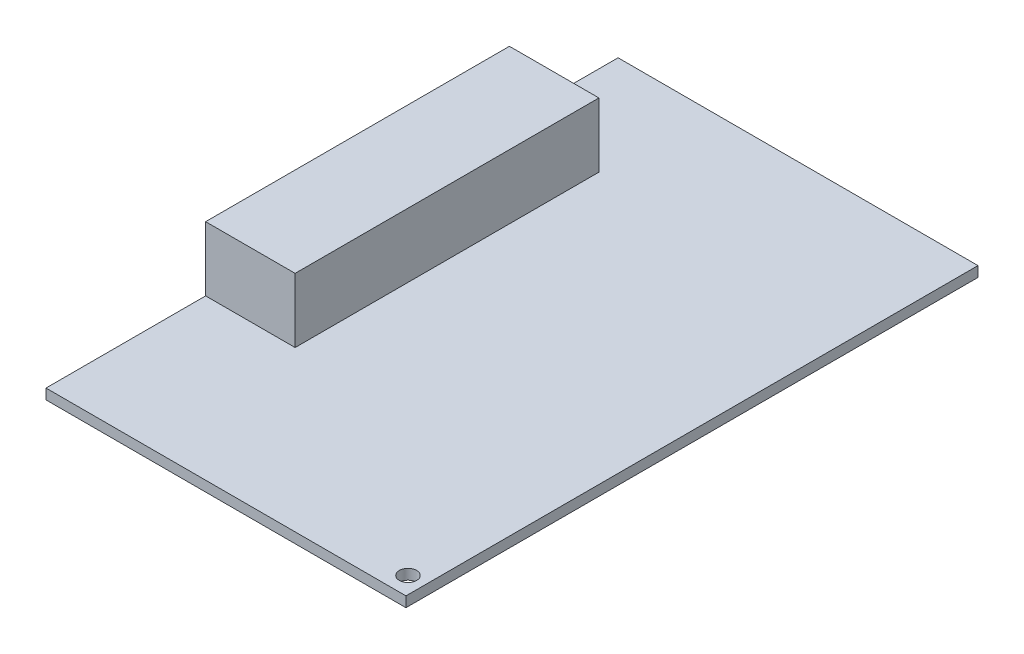
ISO-10303-21;
HEADER;
FILE_DESCRIPTION(('STEP AP214'),'2;1');
FILE_NAME('part.step','',(''),(''),'','','');
FILE_SCHEMA(('AUTOMOTIVE_DESIGN { 1 0 10303 214 1 1 1 1 }'));
ENDSEC;
DATA;
#1=APPLICATION_CONTEXT('core data for automotive mechanical design processes');
#2=APPLICATION_PROTOCOL_DEFINITION('international standard','automotive_design',2000,#1);
#3=PRODUCT_CONTEXT('',#1,'mechanical');
#4=PRODUCT('Part','Part','',(#3));
#5=PRODUCT_RELATED_PRODUCT_CATEGORY('part','',(#4));
#6=PRODUCT_DEFINITION_FORMATION('','',#4);
#7=PRODUCT_DEFINITION_CONTEXT('part definition',#1,'design');
#8=PRODUCT_DEFINITION('design','',#6,#7);
#9=PRODUCT_DEFINITION_SHAPE('','',#8);
#10=(LENGTH_UNIT() NAMED_UNIT(*) SI_UNIT(.MILLI.,.METRE.));
#11=(NAMED_UNIT(*) PLANE_ANGLE_UNIT() SI_UNIT($,.RADIAN.));
#12=(NAMED_UNIT(*) SI_UNIT($,.STERADIAN.) SOLID_ANGLE_UNIT());
#13=UNCERTAINTY_MEASURE_WITH_UNIT(LENGTH_MEASURE(1.E-05),#10,'distance_accuracy_value','');
#14=(GEOMETRIC_REPRESENTATION_CONTEXT(3) GLOBAL_UNCERTAINTY_ASSIGNED_CONTEXT((#13)) GLOBAL_UNIT_ASSIGNED_CONTEXT((#10,
#11,#12)) REPRESENTATION_CONTEXT('',''));
#15=CARTESIAN_POINT('',(0.,0.,0.));
#16=DIRECTION('',(0.,0.,1.));
#17=DIRECTION('',(1.,0.,0.));
#18=AXIS2_PLACEMENT_3D('',#15,#16,#17);
#19=CARTESIAN_POINT('',(0.,1.6,0.));
#20=DIRECTION('',(0.,-1.,0.));
#21=DIRECTION('',(0.,0.,-1.));
#22=AXIS2_PLACEMENT_3D('',#19,#20,#21);
#23=PLANE('',#22);
#24=CARTESIAN_POINT('',(25.41,1.6,41.59));
#25=DIRECTION('',(0.,1.,0.));
#26=DIRECTION('',(0.,0.,1.));
#27=AXIS2_PLACEMENT_3D('',#24,#25,#26);
#28=CIRCLE('',#27,1.35);
#29=CARTESIAN_POINT('',(25.41,1.6,42.94));
#30=VERTEX_POINT('',#29);
#31=EDGE_CURVE('E297',#30,#30,#28,.T.);
#32=ORIENTED_EDGE('',*,*,#31,.F.);
#33=EDGE_LOOP('',(#32));
#34=FACE_BOUND('',#33,.T.);
#35=DIRECTION('',(-1.,0.,0.));
#36=VECTOR('',#35,1.);
#37=CARTESIAN_POINT('',(-28.,1.6,-27.59776896));
#38=LINE('',#37,#36);
#39=CARTESIAN_POINT('',(-14.0750144,1.6,-27.59776896));
#40=VERTEX_POINT('',#39);
#41=CARTESIAN_POINT('',(-28.,1.6,-27.59776896));
#42=VERTEX_POINT('',#41);
#43=EDGE_CURVE('E55',#40,#42,#38,.T.);
#44=ORIENTED_EDGE('',*,*,#43,.F.);
#45=DIRECTION('',(0.,0.,-1.));
#46=VECTOR('',#45,1.);
#47=CARTESIAN_POINT('',(-14.0750144,1.6,-27.59776896));
#48=LINE('',#47,#46);
#49=CARTESIAN_POINT('',(-14.0750144,1.6,19.66628224));
#50=VERTEX_POINT('',#49);
#51=EDGE_CURVE('E304',#50,#40,#48,.T.);
#52=ORIENTED_EDGE('',*,*,#51,.F.);
#53=DIRECTION('',(1.,0.,0.));
#54=VECTOR('',#53,1.);
#55=CARTESIAN_POINT('',(-28.,1.6,19.66628224));
#56=LINE('',#55,#54);
#57=CARTESIAN_POINT('',(-28.,1.6,19.66628224));
#58=VERTEX_POINT('',#57);
#59=EDGE_CURVE('E61',#58,#50,#56,.T.);
#60=ORIENTED_EDGE('',*,*,#59,.F.);
#61=DIRECTION('',(0.,0.,1.));
#62=VECTOR('',#61,1.);
#63=CARTESIAN_POINT('',(-28.,1.6,44.5));
#64=LINE('',#63,#62);
#65=CARTESIAN_POINT('',(-28.,1.6,44.5));
#66=VERTEX_POINT('',#65);
#67=EDGE_CURVE('E126',#58,#66,#64,.T.);
#68=ORIENTED_EDGE('',*,*,#67,.T.);
#69=DIRECTION('',(1.,0.,0.));
#70=VECTOR('',#69,1.);
#71=CARTESIAN_POINT('',(-28.,1.6,44.5));
#72=LINE('',#71,#70);
#73=CARTESIAN_POINT('',(28.,1.6,44.5));
#74=VERTEX_POINT('',#73);
#75=EDGE_CURVE('E144',#66,#74,#72,.T.);
#76=ORIENTED_EDGE('',*,*,#75,.T.);
#77=DIRECTION('',(0.,0.,-1.));
#78=VECTOR('',#77,1.);
#79=CARTESIAN_POINT('',(28.,1.6,44.5));
#80=LINE('',#79,#78);
#81=CARTESIAN_POINT('',(28.,1.6,-44.5));
#82=VERTEX_POINT('',#81);
#83=EDGE_CURVE('E136',#74,#82,#80,.T.);
#84=ORIENTED_EDGE('',*,*,#83,.T.);
#85=DIRECTION('',(-1.,0.,0.));
#86=VECTOR('',#85,1.);
#87=CARTESIAN_POINT('',(-28.,1.6,-44.5));
#88=LINE('',#87,#86);
#89=CARTESIAN_POINT('',(-28.,1.6,-44.5));
#90=VERTEX_POINT('',#89);
#91=EDGE_CURVE('E139',#82,#90,#88,.T.);
#92=ORIENTED_EDGE('',*,*,#91,.T.);
#93=EDGE_CURVE('E142',#90,#42,#64,.T.);
#94=ORIENTED_EDGE('',*,*,#93,.T.);
#95=EDGE_LOOP('',(#44,#52,#60,#68,#76,#84,#92,#94));
#96=FACE_BOUND('',#95,.T.);
#97=ADVANCED_FACE('F39',(#34,#96),#23,.F.);
#98=CARTESIAN_POINT('',(28.,1.6,44.5));
#99=DIRECTION('',(-1.,0.,0.));
#100=DIRECTION('',(0.,0.,1.));
#101=AXIS2_PLACEMENT_3D('',#98,#99,#100);
#102=PLANE('',#101);
#103=DIRECTION('',(0.,0.,-1.));
#104=VECTOR('',#103,1.);
#105=CARTESIAN_POINT('',(28.,0.,44.5));
#106=LINE('',#105,#104);
#107=CARTESIAN_POINT('',(28.,0.,44.5));
#108=VERTEX_POINT('',#107);
#109=CARTESIAN_POINT('',(28.,0.,-44.5));
#110=VERTEX_POINT('',#109);
#111=EDGE_CURVE('E127',#108,#110,#106,.T.);
#112=ORIENTED_EDGE('',*,*,#111,.T.);
#113=DIRECTION('',(0.,-1.,0.));
#114=VECTOR('',#113,1.);
#115=CARTESIAN_POINT('',(28.,1.6,-44.5));
#116=LINE('',#115,#114);
#117=EDGE_CURVE('E11',#82,#110,#116,.T.);
#118=ORIENTED_EDGE('',*,*,#117,.F.);
#119=ORIENTED_EDGE('',*,*,#83,.F.);
#120=DIRECTION('',(0.,-1.,0.));
#121=VECTOR('',#120,1.);
#122=CARTESIAN_POINT('',(28.,1.6,44.5));
#123=LINE('',#122,#121);
#124=EDGE_CURVE('E145',#74,#108,#123,.T.);
#125=ORIENTED_EDGE('',*,*,#124,.T.);
#126=EDGE_LOOP('',(#112,#118,#119,#125));
#127=FACE_BOUND('',#126,.T.);
#128=ADVANCED_FACE('F41',(#127),#102,.F.);
#129=CARTESIAN_POINT('',(-28.,1.6,-44.5));
#130=DIRECTION('',(0.,0.,1.));
#131=DIRECTION('',(1.,0.,0.));
#132=AXIS2_PLACEMENT_3D('',#129,#130,#131);
#133=PLANE('',#132);
#134=DIRECTION('',(-1.,0.,0.));
#135=VECTOR('',#134,1.);
#136=CARTESIAN_POINT('',(-28.,0.,-44.5));
#137=LINE('',#136,#135);
#138=CARTESIAN_POINT('',(-28.,0.,-44.5));
#139=VERTEX_POINT('',#138);
#140=EDGE_CURVE('E130',#110,#139,#137,.T.);
#141=ORIENTED_EDGE('',*,*,#140,.T.);
#142=DIRECTION('',(0.,-1.,0.));
#143=VECTOR('',#142,1.);
#144=CARTESIAN_POINT('',(-28.,1.6,-44.5));
#145=LINE('',#144,#143);
#146=EDGE_CURVE('E48',#90,#139,#145,.T.);
#147=ORIENTED_EDGE('',*,*,#146,.F.);
#148=ORIENTED_EDGE('',*,*,#91,.F.);
#149=ORIENTED_EDGE('',*,*,#117,.T.);
#150=EDGE_LOOP('',(#141,#147,#148,#149));
#151=FACE_BOUND('',#150,.T.);
#152=ADVANCED_FACE('F172',(#151),#133,.F.);
#153=CARTESIAN_POINT('',(-28.,1.6,44.5));
#154=DIRECTION('',(1.,0.,0.));
#155=DIRECTION('',(0.,0.,-1.));
#156=AXIS2_PLACEMENT_3D('',#153,#154,#155);
#157=PLANE('',#156);
#158=DIRECTION('',(0.,0.,1.));
#159=VECTOR('',#158,1.);
#160=CARTESIAN_POINT('',(-28.,0.,44.5));
#161=LINE('',#160,#159);
#162=CARTESIAN_POINT('',(-28.,0.,44.5));
#163=VERTEX_POINT('',#162);
#164=EDGE_CURVE('E148',#139,#163,#161,.T.);
#165=ORIENTED_EDGE('',*,*,#164,.T.);
#166=DIRECTION('',(0.,-1.,0.));
#167=VECTOR('',#166,1.);
#168=CARTESIAN_POINT('',(-28.,1.6,44.5));
#169=LINE('',#168,#167);
#170=EDGE_CURVE('E153',#66,#163,#169,.T.);
#171=ORIENTED_EDGE('',*,*,#170,.F.);
#172=ORIENTED_EDGE('',*,*,#67,.F.);
#173=DIRECTION('',(0.,-1.,0.));
#174=VECTOR('',#173,1.);
#175=CARTESIAN_POINT('',(-28.,11.6,19.66628224));
#176=LINE('',#175,#174);
#177=CARTESIAN_POINT('',(-28.,11.6,19.66628224));
#178=VERTEX_POINT('',#177);
#179=EDGE_CURVE('E108',#178,#58,#176,.T.);
#180=ORIENTED_EDGE('',*,*,#179,.F.);
#181=DIRECTION('',(0.,0.,1.));
#182=VECTOR('',#181,1.);
#183=CARTESIAN_POINT('',(-28.,11.6,-27.59776896));
#184=LINE('',#183,#182);
#185=CARTESIAN_POINT('',(-28.,11.6,-27.59776896));
#186=VERTEX_POINT('',#185);
#187=EDGE_CURVE('E114',#186,#178,#184,.T.);
#188=ORIENTED_EDGE('',*,*,#187,.F.);
#189=DIRECTION('',(0.,-1.,0.));
#190=VECTOR('',#189,1.);
#191=CARTESIAN_POINT('',(-28.,11.6,-27.59776896));
#192=LINE('',#191,#190);
#193=EDGE_CURVE('E302',#186,#42,#192,.T.);
#194=ORIENTED_EDGE('',*,*,#193,.T.);
#195=ORIENTED_EDGE('',*,*,#93,.F.);
#196=ORIENTED_EDGE('',*,*,#146,.T.);
#197=EDGE_LOOP('',(#165,#171,#172,#180,#188,#194,#195,#196));
#198=FACE_BOUND('',#197,.T.);
#199=ADVANCED_FACE('F124',(#198),#157,.F.);
#200=CARTESIAN_POINT('',(-28.,1.6,44.5));
#201=DIRECTION('',(0.,0.,-1.));
#202=DIRECTION('',(-1.,0.,0.));
#203=AXIS2_PLACEMENT_3D('',#200,#201,#202);
#204=PLANE('',#203);
#205=DIRECTION('',(1.,0.,0.));
#206=VECTOR('',#205,1.);
#207=CARTESIAN_POINT('',(-28.,0.,44.5));
#208=LINE('',#207,#206);
#209=EDGE_CURVE('E140',#163,#108,#208,.T.);
#210=ORIENTED_EDGE('',*,*,#209,.T.);
#211=ORIENTED_EDGE('',*,*,#124,.F.);
#212=ORIENTED_EDGE('',*,*,#75,.F.);
#213=ORIENTED_EDGE('',*,*,#170,.T.);
#214=EDGE_LOOP('',(#210,#211,#212,#213));
#215=FACE_BOUND('',#214,.T.);
#216=ADVANCED_FACE('F167',(#215),#204,.F.);
#217=CARTESIAN_POINT('',(0.,0.,0.));
#218=DIRECTION('',(0.,-1.,0.));
#219=DIRECTION('',(0.,0.,-1.));
#220=AXIS2_PLACEMENT_3D('',#217,#218,#219);
#221=PLANE('',#220);
#222=CARTESIAN_POINT('',(25.41,0.,41.59));
#223=DIRECTION('',(0.,-1.,0.));
#224=DIRECTION('',(0.,0.,-1.));
#225=AXIS2_PLACEMENT_3D('',#222,#223,#224);
#226=CIRCLE('',#225,1.35);
#227=CARTESIAN_POINT('',(25.41,0.,40.24));
#228=VERTEX_POINT('',#227);
#229=EDGE_CURVE('E43',#228,#228,#226,.T.);
#230=ORIENTED_EDGE('',*,*,#229,.F.);
#231=EDGE_LOOP('',(#230));
#232=FACE_BOUND('',#231,.T.);
#233=ORIENTED_EDGE('',*,*,#111,.F.);
#234=ORIENTED_EDGE('',*,*,#209,.F.);
#235=ORIENTED_EDGE('',*,*,#164,.F.);
#236=ORIENTED_EDGE('',*,*,#140,.F.);
#237=EDGE_LOOP('',(#233,#234,#235,#236));
#238=FACE_BOUND('',#237,.T.);
#239=ADVANCED_FACE('F164',(#232,#238),#221,.T.);
#240=CARTESIAN_POINT('',(-28.,11.6,19.66628224));
#241=DIRECTION('',(0.,0.,-1.));
#242=DIRECTION('',(-1.,0.,0.));
#243=AXIS2_PLACEMENT_3D('',#240,#241,#242);
#244=PLANE('',#243);
#245=ORIENTED_EDGE('',*,*,#59,.T.);
#246=DIRECTION('',(0.,-1.,0.));
#247=VECTOR('',#246,1.);
#248=CARTESIAN_POINT('',(-14.0750144,11.6,19.66628224));
#249=LINE('',#248,#247);
#250=CARTESIAN_POINT('',(-14.0750144,11.6,19.66628224));
#251=VERTEX_POINT('',#250);
#252=EDGE_CURVE('E110',#251,#50,#249,.T.);
#253=ORIENTED_EDGE('',*,*,#252,.F.);
#254=DIRECTION('',(1.,0.,0.));
#255=VECTOR('',#254,1.);
#256=CARTESIAN_POINT('',(-28.,11.6,19.66628224));
#257=LINE('',#256,#255);
#258=EDGE_CURVE('E104',#178,#251,#257,.T.);
#259=ORIENTED_EDGE('',*,*,#258,.F.);
#260=ORIENTED_EDGE('',*,*,#179,.T.);
#261=EDGE_LOOP('',(#245,#253,#259,#260));
#262=FACE_BOUND('',#261,.T.);
#263=ADVANCED_FACE('F106',(#262),#244,.F.);
#264=CARTESIAN_POINT('',(-14.0750144,11.6,-27.59776896));
#265=DIRECTION('',(-1.,0.,0.));
#266=DIRECTION('',(0.,0.,1.));
#267=AXIS2_PLACEMENT_3D('',#264,#265,#266);
#268=PLANE('',#267);
#269=ORIENTED_EDGE('',*,*,#51,.T.);
#270=DIRECTION('',(0.,-1.,0.));
#271=VECTOR('',#270,1.);
#272=CARTESIAN_POINT('',(-14.0750144,11.6,-27.59776896));
#273=LINE('',#272,#271);
#274=CARTESIAN_POINT('',(-14.0750144,11.6,-27.59776896));
#275=VERTEX_POINT('',#274);
#276=EDGE_CURVE('E132',#275,#40,#273,.T.);
#277=ORIENTED_EDGE('',*,*,#276,.F.);
#278=DIRECTION('',(0.,0.,-1.));
#279=VECTOR('',#278,1.);
#280=CARTESIAN_POINT('',(-14.0750144,11.6,-27.59776896));
#281=LINE('',#280,#279);
#282=EDGE_CURVE('E113',#251,#275,#281,.T.);
#283=ORIENTED_EDGE('',*,*,#282,.F.);
#284=ORIENTED_EDGE('',*,*,#252,.T.);
#285=EDGE_LOOP('',(#269,#277,#283,#284));
#286=FACE_BOUND('',#285,.T.);
#287=ADVANCED_FACE('F212',(#286),#268,.F.);
#288=CARTESIAN_POINT('',(-28.,11.6,-27.59776896));
#289=DIRECTION('',(0.,0.,1.));
#290=DIRECTION('',(1.,0.,0.));
#291=AXIS2_PLACEMENT_3D('',#288,#289,#290);
#292=PLANE('',#291);
#293=ORIENTED_EDGE('',*,*,#43,.T.);
#294=ORIENTED_EDGE('',*,*,#193,.F.);
#295=DIRECTION('',(-1.,0.,0.));
#296=VECTOR('',#295,1.);
#297=CARTESIAN_POINT('',(-28.,11.6,-27.59776896));
#298=LINE('',#297,#296);
#299=EDGE_CURVE('E119',#275,#186,#298,.T.);
#300=ORIENTED_EDGE('',*,*,#299,.F.);
#301=ORIENTED_EDGE('',*,*,#276,.T.);
#302=EDGE_LOOP('',(#293,#294,#300,#301));
#303=FACE_BOUND('',#302,.T.);
#304=ADVANCED_FACE('F218',(#303),#292,.F.);
#305=CARTESIAN_POINT('',(0.,11.6,0.));
#306=DIRECTION('',(0.,1.,0.));
#307=DIRECTION('',(0.,0.,1.));
#308=AXIS2_PLACEMENT_3D('',#305,#306,#307);
#309=PLANE('',#308);
#310=ORIENTED_EDGE('',*,*,#187,.T.);
#311=ORIENTED_EDGE('',*,*,#258,.T.);
#312=ORIENTED_EDGE('',*,*,#282,.T.);
#313=ORIENTED_EDGE('',*,*,#299,.T.);
#314=EDGE_LOOP('',(#310,#311,#312,#313));
#315=FACE_BOUND('',#314,.T.);
#316=ADVANCED_FACE('F117',(#315),#309,.T.);
#317=CARTESIAN_POINT('',(25.41,-8.4,41.59));
#318=DIRECTION('',(0.,1.,0.));
#319=DIRECTION('',(0.,0.,1.));
#320=AXIS2_PLACEMENT_3D('',#317,#318,#319);
#321=CYLINDRICAL_SURFACE('',#320,1.35);
#322=ORIENTED_EDGE('',*,*,#229,.T.);
#323=EDGE_LOOP('',(#322));
#324=FACE_BOUND('',#323,.T.);
#325=ORIENTED_EDGE('',*,*,#31,.T.);
#326=EDGE_LOOP('',(#325));
#327=FACE_BOUND('',#326,.T.);
#328=ADVANCED_FACE('F231',(#324,#327),#321,.F.);
#329=CLOSED_SHELL('',(#97,#128,#152,#199,#216,#239,#263,#287,#304,#316,#328));
#330=MANIFOLD_SOLID_BREP('B2',#329);
#331=ADVANCED_BREP_SHAPE_REPRESENTATION('',(#18,#330),#14);
#332=SHAPE_DEFINITION_REPRESENTATION(#9,#331);
ENDSEC;
END-ISO-10303-21;
